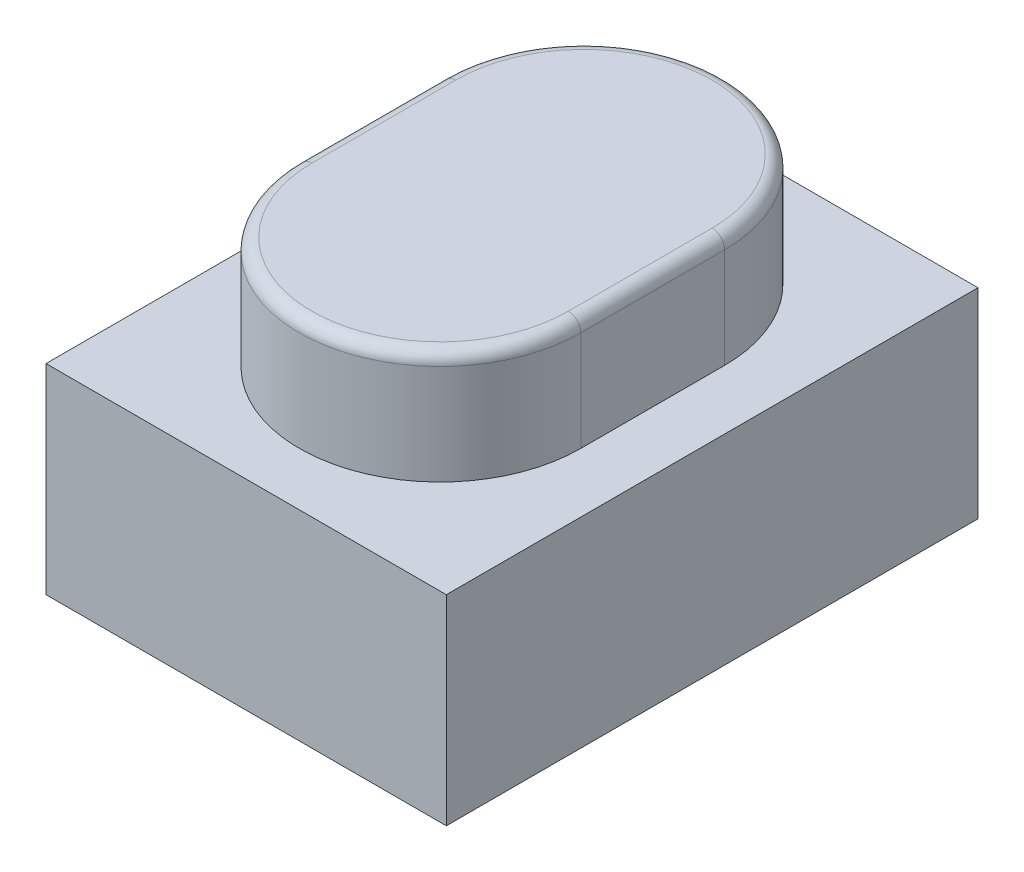
ISO-10303-21;
HEADER;
FILE_DESCRIPTION(('STEP AP214'),'2;1');
FILE_NAME('part.step','',(''),(''),'','','');
FILE_SCHEMA(('AUTOMOTIVE_DESIGN { 1 0 10303 214 1 1 1 1 }'));
ENDSEC;
DATA;
#1=APPLICATION_CONTEXT('core data for automotive mechanical design processes');
#2=APPLICATION_PROTOCOL_DEFINITION('international standard','automotive_design',2000,#1);
#3=PRODUCT_CONTEXT('',#1,'mechanical');
#4=PRODUCT('Part','Part','',(#3));
#5=PRODUCT_RELATED_PRODUCT_CATEGORY('part','',(#4));
#6=PRODUCT_DEFINITION_FORMATION('','',#4);
#7=PRODUCT_DEFINITION_CONTEXT('part definition',#1,'design');
#8=PRODUCT_DEFINITION('design','',#6,#7);
#9=PRODUCT_DEFINITION_SHAPE('','',#8);
#10=(LENGTH_UNIT() NAMED_UNIT(*) SI_UNIT(.MILLI.,.METRE.));
#11=(NAMED_UNIT(*) PLANE_ANGLE_UNIT() SI_UNIT($,.RADIAN.));
#12=(NAMED_UNIT(*) SI_UNIT($,.STERADIAN.) SOLID_ANGLE_UNIT());
#13=UNCERTAINTY_MEASURE_WITH_UNIT(LENGTH_MEASURE(1.E-05),#10,'distance_accuracy_value','');
#14=(GEOMETRIC_REPRESENTATION_CONTEXT(3) GLOBAL_UNCERTAINTY_ASSIGNED_CONTEXT((#13)) GLOBAL_UNIT_ASSIGNED_CONTEXT((#10,
#11,#12)) REPRESENTATION_CONTEXT('',''));
#15=CARTESIAN_POINT('',(0.,0.,0.));
#16=DIRECTION('',(0.,0.,1.));
#17=DIRECTION('',(1.,0.,0.));
#18=AXIS2_PLACEMENT_3D('',#15,#16,#17);
#19=CARTESIAN_POINT('',(1.6,1.6,-2.125));
#20=DIRECTION('',(-1.,0.,0.));
#21=DIRECTION('',(0.,0.,1.));
#22=AXIS2_PLACEMENT_3D('',#19,#20,#21);
#23=PLANE('',#22);
#24=DIRECTION('',(0.,0.,-1.));
#25=VECTOR('',#24,1.);
#26=CARTESIAN_POINT('',(1.6,0.,-2.125));
#27=LINE('',#26,#25);
#28=CARTESIAN_POINT('',(1.6,0.,2.125));
#29=VERTEX_POINT('',#28);
#30=CARTESIAN_POINT('',(1.6,0.,-2.125));
#31=VERTEX_POINT('',#30);
#32=EDGE_CURVE('E141',#29,#31,#27,.T.);
#33=ORIENTED_EDGE('',*,*,#32,.T.);
#34=DIRECTION('',(0.,-1.,0.));
#35=VECTOR('',#34,1.);
#36=CARTESIAN_POINT('',(1.6,1.6,-2.125));
#37=LINE('',#36,#35);
#38=CARTESIAN_POINT('',(1.6,1.6,-2.125));
#39=VERTEX_POINT('',#38);
#40=EDGE_CURVE('E168',#39,#31,#37,.T.);
#41=ORIENTED_EDGE('',*,*,#40,.F.);
#42=DIRECTION('',(0.,0.,-1.));
#43=VECTOR('',#42,1.);
#44=CARTESIAN_POINT('',(1.6,1.6,-2.125));
#45=LINE('',#44,#43);
#46=CARTESIAN_POINT('',(1.6,1.6,2.125));
#47=VERTEX_POINT('',#46);
#48=EDGE_CURVE('E142',#47,#39,#45,.T.);
#49=ORIENTED_EDGE('',*,*,#48,.F.);
#50=DIRECTION('',(0.,-1.,0.));
#51=VECTOR('',#50,1.);
#52=CARTESIAN_POINT('',(1.6,1.6,2.125));
#53=LINE('',#52,#51);
#54=EDGE_CURVE('E152',#47,#29,#53,.T.);
#55=ORIENTED_EDGE('',*,*,#54,.T.);
#56=EDGE_LOOP('',(#33,#41,#49,#55));
#57=FACE_BOUND('',#56,.T.);
#58=ADVANCED_FACE('F36',(#57),#23,.F.);
#59=CARTESIAN_POINT('',(-1.6,1.6,-2.125));
#60=DIRECTION('',(0.,0.,1.));
#61=DIRECTION('',(1.,0.,0.));
#62=AXIS2_PLACEMENT_3D('',#59,#60,#61);
#63=PLANE('',#62);
#64=DIRECTION('',(-1.,0.,0.));
#65=VECTOR('',#64,1.);
#66=CARTESIAN_POINT('',(-1.6,0.,-2.125));
#67=LINE('',#66,#65);
#68=CARTESIAN_POINT('',(-1.6,0.,-2.125));
#69=VERTEX_POINT('',#68);
#70=EDGE_CURVE('E155',#31,#69,#67,.T.);
#71=ORIENTED_EDGE('',*,*,#70,.T.);
#72=DIRECTION('',(0.,-1.,0.));
#73=VECTOR('',#72,1.);
#74=CARTESIAN_POINT('',(-1.6,1.6,-2.125));
#75=LINE('',#74,#73);
#76=CARTESIAN_POINT('',(-1.6,1.6,-2.125));
#77=VERTEX_POINT('',#76);
#78=EDGE_CURVE('E165',#77,#69,#75,.T.);
#79=ORIENTED_EDGE('',*,*,#78,.F.);
#80=DIRECTION('',(-1.,0.,0.));
#81=VECTOR('',#80,1.);
#82=CARTESIAN_POINT('',(-1.6,1.6,-2.125));
#83=LINE('',#82,#81);
#84=EDGE_CURVE('E145',#39,#77,#83,.T.);
#85=ORIENTED_EDGE('',*,*,#84,.F.);
#86=ORIENTED_EDGE('',*,*,#40,.T.);
#87=EDGE_LOOP('',(#71,#79,#85,#86));
#88=FACE_BOUND('',#87,.T.);
#89=ADVANCED_FACE('F223',(#88),#63,.F.);
#90=CARTESIAN_POINT('',(-1.6,1.6,-2.125));
#91=DIRECTION('',(1.,0.,0.));
#92=DIRECTION('',(0.,0.,-1.));
#93=AXIS2_PLACEMENT_3D('',#90,#91,#92);
#94=PLANE('',#93);
#95=DIRECTION('',(0.,0.,1.));
#96=VECTOR('',#95,1.);
#97=CARTESIAN_POINT('',(-1.6,0.,-2.125));
#98=LINE('',#97,#96);
#99=CARTESIAN_POINT('',(-1.6,0.,2.125));
#100=VERTEX_POINT('',#99);
#101=EDGE_CURVE('E157',#69,#100,#98,.T.);
#102=ORIENTED_EDGE('',*,*,#101,.T.);
#103=DIRECTION('',(0.,-1.,0.));
#104=VECTOR('',#103,1.);
#105=CARTESIAN_POINT('',(-1.6,1.6,2.125));
#106=LINE('',#105,#104);
#107=CARTESIAN_POINT('',(-1.6,1.6,2.125));
#108=VERTEX_POINT('',#107);
#109=EDGE_CURVE('E162',#108,#100,#106,.T.);
#110=ORIENTED_EDGE('',*,*,#109,.F.);
#111=DIRECTION('',(0.,0.,1.));
#112=VECTOR('',#111,1.);
#113=CARTESIAN_POINT('',(-1.6,1.6,-2.125));
#114=LINE('',#113,#112);
#115=EDGE_CURVE('E148',#77,#108,#114,.T.);
#116=ORIENTED_EDGE('',*,*,#115,.F.);
#117=ORIENTED_EDGE('',*,*,#78,.T.);
#118=EDGE_LOOP('',(#102,#110,#116,#117));
#119=FACE_BOUND('',#118,.T.);
#120=ADVANCED_FACE('F229',(#119),#94,.F.);
#121=CARTESIAN_POINT('',(-1.6,1.6,2.125));
#122=DIRECTION('',(0.,0.,-1.));
#123=DIRECTION('',(-1.,0.,0.));
#124=AXIS2_PLACEMENT_3D('',#121,#122,#123);
#125=PLANE('',#124);
#126=DIRECTION('',(1.,0.,0.));
#127=VECTOR('',#126,1.);
#128=CARTESIAN_POINT('',(-1.6,0.,2.125));
#129=LINE('',#128,#127);
#130=EDGE_CURVE('E146',#100,#29,#129,.T.);
#131=ORIENTED_EDGE('',*,*,#130,.T.);
#132=ORIENTED_EDGE('',*,*,#54,.F.);
#133=DIRECTION('',(1.,0.,0.));
#134=VECTOR('',#133,1.);
#135=CARTESIAN_POINT('',(-1.6,1.6,2.125));
#136=LINE('',#135,#134);
#137=EDGE_CURVE('E150',#108,#47,#136,.T.);
#138=ORIENTED_EDGE('',*,*,#137,.F.);
#139=ORIENTED_EDGE('',*,*,#109,.T.);
#140=EDGE_LOOP('',(#131,#132,#138,#139));
#141=FACE_BOUND('',#140,.T.);
#142=ADVANCED_FACE('F308',(#141),#125,.F.);
#143=CARTESIAN_POINT('',(0.,1.6,0.));
#144=DIRECTION('',(0.,1.,0.));
#145=DIRECTION('',(0.,0.,1.));
#146=AXIS2_PLACEMENT_3D('',#143,#144,#145);
#147=PLANE('',#146);
#148=CARTESIAN_POINT('',(0.,1.6,-0.575));
#149=DIRECTION('',(0.,1.,0.));
#150=DIRECTION('',(0.,0.,1.));
#151=AXIS2_PLACEMENT_3D('',#148,#149,#150);
#152=CIRCLE('',#151,1.125);
#153=CARTESIAN_POINT('',(1.125,1.6,-0.575000000000001));
#154=VERTEX_POINT('',#153);
#155=CARTESIAN_POINT('',(-1.125,1.6,-0.575));
#156=VERTEX_POINT('',#155);
#157=EDGE_CURVE('E132',#154,#156,#152,.T.);
#158=ORIENTED_EDGE('',*,*,#157,.F.);
#159=DIRECTION('',(0.,0.,-1.));
#160=VECTOR('',#159,1.);
#161=CARTESIAN_POINT('',(1.125,1.6,-0.575000000000001));
#162=LINE('',#161,#160);
#163=CARTESIAN_POINT('',(1.125,1.6,0.575));
#164=VERTEX_POINT('',#163);
#165=EDGE_CURVE('E129',#164,#154,#162,.T.);
#166=ORIENTED_EDGE('',*,*,#165,.F.);
#167=CARTESIAN_POINT('',(0.,1.6,0.575));
#168=DIRECTION('',(0.,1.,0.));
#169=DIRECTION('',(0.,0.,1.));
#170=AXIS2_PLACEMENT_3D('',#167,#168,#169);
#171=CIRCLE('',#170,1.125);
#172=CARTESIAN_POINT('',(-1.125,1.6,0.575));
#173=VERTEX_POINT('',#172);
#174=EDGE_CURVE('E115',#173,#164,#171,.T.);
#175=ORIENTED_EDGE('',*,*,#174,.F.);
#176=DIRECTION('',(0.,0.,1.));
#177=VECTOR('',#176,1.);
#178=CARTESIAN_POINT('',(-1.125,1.6,-0.575));
#179=LINE('',#178,#177);
#180=EDGE_CURVE('E126',#156,#173,#179,.T.);
#181=ORIENTED_EDGE('',*,*,#180,.F.);
#182=EDGE_LOOP('',(#158,#166,#175,#181));
#183=FACE_BOUND('',#182,.T.);
#184=ORIENTED_EDGE('',*,*,#48,.T.);
#185=ORIENTED_EDGE('',*,*,#84,.T.);
#186=ORIENTED_EDGE('',*,*,#115,.T.);
#187=ORIENTED_EDGE('',*,*,#137,.T.);
#188=EDGE_LOOP('',(#184,#185,#186,#187));
#189=FACE_BOUND('',#188,.T.);
#190=ADVANCED_FACE('F124',(#183,#189),#147,.T.);
#191=CARTESIAN_POINT('',(0.,0.,0.));
#192=DIRECTION('',(0.,1.,0.));
#193=DIRECTION('',(0.,0.,1.));
#194=AXIS2_PLACEMENT_3D('',#191,#192,#193);
#195=PLANE('',#194);
#196=ORIENTED_EDGE('',*,*,#32,.F.);
#197=ORIENTED_EDGE('',*,*,#130,.F.);
#198=ORIENTED_EDGE('',*,*,#101,.F.);
#199=ORIENTED_EDGE('',*,*,#70,.F.);
#200=EDGE_LOOP('',(#196,#197,#198,#199));
#201=FACE_BOUND('',#200,.T.);
#202=ADVANCED_FACE('F291',(#201),#195,.F.);
#203=CARTESIAN_POINT('',(0.,2.5,-0.575));
#204=DIRECTION('',(0.,-1.,0.));
#205=DIRECTION('',(0.,0.,-1.));
#206=AXIS2_PLACEMENT_3D('',#203,#204,#205);
#207=CYLINDRICAL_SURFACE('',#206,1.125);
#208=DIRECTION('',(0.,-1.,0.));
#209=VECTOR('',#208,1.);
#210=CARTESIAN_POINT('',(-1.125,2.5,-0.575));
#211=LINE('',#210,#209);
#212=CARTESIAN_POINT('',(-1.125,2.4,-0.575));
#213=VERTEX_POINT('',#212);
#214=EDGE_CURVE('E117',#213,#156,#211,.T.);
#215=ORIENTED_EDGE('',*,*,#214,.F.);
#216=CARTESIAN_POINT('',(0.,2.4,-0.575));
#217=DIRECTION('',(0.,1.,0.));
#218=DIRECTION('',(0.,0.,1.));
#219=AXIS2_PLACEMENT_3D('',#216,#217,#218);
#220=CIRCLE('',#219,1.125);
#221=CARTESIAN_POINT('',(1.125,2.4,-0.575000000000001));
#222=VERTEX_POINT('',#221);
#223=EDGE_CURVE('E11',#213,#222,#220,.F.);
#224=ORIENTED_EDGE('',*,*,#223,.T.);
#225=DIRECTION('',(0.,-1.,0.));
#226=VECTOR('',#225,1.);
#227=CARTESIAN_POINT('',(1.125,2.5,-0.575000000000001));
#228=LINE('',#227,#226);
#229=EDGE_CURVE('E137',#222,#154,#228,.T.);
#230=ORIENTED_EDGE('',*,*,#229,.T.);
#231=ORIENTED_EDGE('',*,*,#157,.T.);
#232=EDGE_LOOP('',(#215,#224,#230,#231));
#233=FACE_BOUND('',#232,.T.);
#234=ADVANCED_FACE('F206',(#233),#207,.T.);
#235=CARTESIAN_POINT('',(-1.125,2.5,-0.575));
#236=DIRECTION('',(1.,0.,0.));
#237=DIRECTION('',(0.,0.,-1.));
#238=AXIS2_PLACEMENT_3D('',#235,#236,#237);
#239=PLANE('',#238);
#240=DIRECTION('',(0.,-1.,0.));
#241=VECTOR('',#240,1.);
#242=CARTESIAN_POINT('',(-1.125,2.5,0.575));
#243=LINE('',#242,#241);
#244=CARTESIAN_POINT('',(-1.125,2.4,0.575));
#245=VERTEX_POINT('',#244);
#246=EDGE_CURVE('E112',#245,#173,#243,.T.);
#247=ORIENTED_EDGE('',*,*,#246,.F.);
#248=DIRECTION('',(0.,0.,1.));
#249=VECTOR('',#248,1.);
#250=CARTESIAN_POINT('',(-1.125,2.4,-0.575));
#251=LINE('',#250,#249);
#252=EDGE_CURVE('E45',#245,#213,#251,.F.);
#253=ORIENTED_EDGE('',*,*,#252,.T.);
#254=ORIENTED_EDGE('',*,*,#214,.T.);
#255=ORIENTED_EDGE('',*,*,#180,.T.);
#256=EDGE_LOOP('',(#247,#253,#254,#255));
#257=FACE_BOUND('',#256,.T.);
#258=ADVANCED_FACE('F131',(#257),#239,.F.);
#259=CARTESIAN_POINT('',(0.,2.5,0.575));
#260=DIRECTION('',(0.,-1.,0.));
#261=DIRECTION('',(0.,0.,-1.));
#262=AXIS2_PLACEMENT_3D('',#259,#260,#261);
#263=CYLINDRICAL_SURFACE('',#262,1.125);
#264=DIRECTION('',(0.,-1.,0.));
#265=VECTOR('',#264,1.);
#266=CARTESIAN_POINT('',(1.125,2.5,0.575));
#267=LINE('',#266,#265);
#268=CARTESIAN_POINT('',(1.125,2.4,0.575));
#269=VERTEX_POINT('',#268);
#270=EDGE_CURVE('E118',#269,#164,#267,.T.);
#271=ORIENTED_EDGE('',*,*,#270,.F.);
#272=CARTESIAN_POINT('',(0.,2.4,0.575));
#273=DIRECTION('',(0.,1.,0.));
#274=DIRECTION('',(0.,0.,1.));
#275=AXIS2_PLACEMENT_3D('',#272,#273,#274);
#276=CIRCLE('',#275,1.125);
#277=EDGE_CURVE('E60',#269,#245,#276,.F.);
#278=ORIENTED_EDGE('',*,*,#277,.T.);
#279=ORIENTED_EDGE('',*,*,#246,.T.);
#280=ORIENTED_EDGE('',*,*,#174,.T.);
#281=EDGE_LOOP('',(#271,#278,#279,#280));
#282=FACE_BOUND('',#281,.T.);
#283=ADVANCED_FACE('F114',(#282),#263,.T.);
#284=CARTESIAN_POINT('',(1.125,2.5,-0.575000000000001));
#285=DIRECTION('',(-1.,0.,0.));
#286=DIRECTION('',(0.,0.,1.));
#287=AXIS2_PLACEMENT_3D('',#284,#285,#286);
#288=PLANE('',#287);
#289=ORIENTED_EDGE('',*,*,#229,.F.);
#290=DIRECTION('',(0.,0.,-1.));
#291=VECTOR('',#290,1.);
#292=CARTESIAN_POINT('',(1.125,2.4,0.575));
#293=LINE('',#292,#291);
#294=EDGE_CURVE('E180',#222,#269,#293,.F.);
#295=ORIENTED_EDGE('',*,*,#294,.T.);
#296=ORIENTED_EDGE('',*,*,#270,.T.);
#297=ORIENTED_EDGE('',*,*,#165,.T.);
#298=EDGE_LOOP('',(#289,#295,#296,#297));
#299=FACE_BOUND('',#298,.T.);
#300=ADVANCED_FACE('F209',(#299),#288,.F.);
#301=CARTESIAN_POINT('',(0.,2.5,-0.575));
#302=DIRECTION('',(0.,1.,0.));
#303=DIRECTION('',(0.,0.,1.));
#304=AXIS2_PLACEMENT_3D('',#301,#302,#303);
#305=PLANE('',#304);
#306=CARTESIAN_POINT('',(0.,2.5,0.575));
#307=DIRECTION('',(0.,1.,0.));
#308=DIRECTION('',(0.,0.,1.));
#309=AXIS2_PLACEMENT_3D('',#306,#307,#308);
#310=CIRCLE('',#309,1.025);
#311=CARTESIAN_POINT('',(-1.025,2.5,0.575));
#312=VERTEX_POINT('',#311);
#313=CARTESIAN_POINT('',(1.025,2.5,0.575));
#314=VERTEX_POINT('',#313);
#315=EDGE_CURVE('E175',#312,#314,#310,.T.);
#316=ORIENTED_EDGE('',*,*,#315,.T.);
#317=DIRECTION('',(0.,0.,-1.));
#318=VECTOR('',#317,1.);
#319=CARTESIAN_POINT('',(1.025,2.5,-0.575000000000001));
#320=LINE('',#319,#318);
#321=CARTESIAN_POINT('',(1.025,2.5,-0.575000000000001));
#322=VERTEX_POINT('',#321);
#323=EDGE_CURVE('E177',#314,#322,#320,.T.);
#324=ORIENTED_EDGE('',*,*,#323,.T.);
#325=CARTESIAN_POINT('',(0.,2.5,-0.575));
#326=DIRECTION('',(0.,1.,0.));
#327=DIRECTION('',(0.,0.,1.));
#328=AXIS2_PLACEMENT_3D('',#325,#326,#327);
#329=CIRCLE('',#328,1.025);
#330=CARTESIAN_POINT('',(-1.025,2.5,-0.575));
#331=VERTEX_POINT('',#330);
#332=EDGE_CURVE('E171',#322,#331,#329,.T.);
#333=ORIENTED_EDGE('',*,*,#332,.T.);
#334=DIRECTION('',(0.,0.,1.));
#335=VECTOR('',#334,1.);
#336=CARTESIAN_POINT('',(-1.025,2.5,0.575));
#337=LINE('',#336,#335);
#338=EDGE_CURVE('E173',#331,#312,#337,.T.);
#339=ORIENTED_EDGE('',*,*,#338,.T.);
#340=EDGE_LOOP('',(#316,#324,#333,#339));
#341=FACE_BOUND('',#340,.T.);
#342=ADVANCED_FACE('F214',(#341),#305,.T.);
#343=CARTESIAN_POINT('',(-1.025,2.4,-0.575));
#344=DIRECTION('',(0.,0.,-1.));
#345=DIRECTION('',(-1.,0.,0.));
#346=AXIS2_PLACEMENT_3D('',#343,#344,#345);
#347=CYLINDRICAL_SURFACE('',#346,0.1);
#348=CARTESIAN_POINT('',(-1.025,2.4,-0.575));
#349=DIRECTION('',(0.,0.,-1.));
#350=DIRECTION('',(-1.,0.,0.));
#351=AXIS2_PLACEMENT_3D('',#348,#349,#350);
#352=CIRCLE('',#351,0.1);
#353=EDGE_CURVE('E188',#213,#331,#352,.T.);
#354=ORIENTED_EDGE('',*,*,#353,.F.);
#355=ORIENTED_EDGE('',*,*,#252,.F.);
#356=CARTESIAN_POINT('',(-1.025,2.4,0.575));
#357=DIRECTION('',(0.,0.,1.));
#358=DIRECTION('',(1.,0.,0.));
#359=AXIS2_PLACEMENT_3D('',#356,#357,#358);
#360=CIRCLE('',#359,0.1);
#361=EDGE_CURVE('E40',#312,#245,#360,.T.);
#362=ORIENTED_EDGE('',*,*,#361,.F.);
#363=ORIENTED_EDGE('',*,*,#338,.F.);
#364=EDGE_LOOP('',(#354,#355,#362,#363));
#365=FACE_BOUND('',#364,.T.);
#366=ADVANCED_FACE('F38',(#365),#347,.T.);
#367=CARTESIAN_POINT('',(0.,2.4,0.575));
#368=DIRECTION('',(0.,1.,0.));
#369=DIRECTION('',(0.,0.,1.));
#370=AXIS2_PLACEMENT_3D('',#367,#368,#369);
#371=TOROIDAL_SURFACE('',#370,1.025,0.1);
#372=ORIENTED_EDGE('',*,*,#361,.T.);
#373=ORIENTED_EDGE('',*,*,#277,.F.);
#374=CARTESIAN_POINT('',(1.025,2.4,0.575));
#375=DIRECTION('',(0.,0.,-1.));
#376=DIRECTION('',(-1.,0.,0.));
#377=AXIS2_PLACEMENT_3D('',#374,#375,#376);
#378=CIRCLE('',#377,0.1);
#379=EDGE_CURVE('E187',#314,#269,#378,.T.);
#380=ORIENTED_EDGE('',*,*,#379,.F.);
#381=ORIENTED_EDGE('',*,*,#315,.F.);
#382=EDGE_LOOP('',(#372,#373,#380,#381));
#383=FACE_BOUND('',#382,.T.);
#384=ADVANCED_FACE('F198',(#383),#371,.T.);
#385=CARTESIAN_POINT('',(0.,2.4,-0.575));
#386=DIRECTION('',(0.,1.,0.));
#387=DIRECTION('',(0.,0.,1.));
#388=AXIS2_PLACEMENT_3D('',#385,#386,#387);
#389=TOROIDAL_SURFACE('',#388,1.025,0.1);
#390=ORIENTED_EDGE('',*,*,#353,.T.);
#391=ORIENTED_EDGE('',*,*,#332,.F.);
#392=CARTESIAN_POINT('',(1.025,2.4,-0.575000000000001));
#393=DIRECTION('',(0.,0.,1.));
#394=DIRECTION('',(1.,0.,0.));
#395=AXIS2_PLACEMENT_3D('',#392,#393,#394);
#396=CIRCLE('',#395,0.1);
#397=EDGE_CURVE('E185',#222,#322,#396,.T.);
#398=ORIENTED_EDGE('',*,*,#397,.F.);
#399=ORIENTED_EDGE('',*,*,#223,.F.);
#400=EDGE_LOOP('',(#390,#391,#398,#399));
#401=FACE_BOUND('',#400,.T.);
#402=ADVANCED_FACE('F203',(#401),#389,.T.);
#403=CARTESIAN_POINT('',(1.025,2.4,-0.575));
#404=DIRECTION('',(0.,0.,1.));
#405=DIRECTION('',(1.,0.,0.));
#406=AXIS2_PLACEMENT_3D('',#403,#404,#405);
#407=CYLINDRICAL_SURFACE('',#406,0.1);
#408=ORIENTED_EDGE('',*,*,#379,.T.);
#409=ORIENTED_EDGE('',*,*,#294,.F.);
#410=ORIENTED_EDGE('',*,*,#397,.T.);
#411=ORIENTED_EDGE('',*,*,#323,.F.);
#412=EDGE_LOOP('',(#408,#409,#410,#411));
#413=FACE_BOUND('',#412,.T.);
#414=ADVANCED_FACE('F211',(#413),#407,.T.);
#415=CLOSED_SHELL('',(#58,#89,#120,#142,#190,#202,#234,#258,#283,#300,#342,#366,#384,#402,#414));
#416=MANIFOLD_SOLID_BREP('B2',#415);
#417=ADVANCED_BREP_SHAPE_REPRESENTATION('',(#18,#416),#14);
#418=SHAPE_DEFINITION_REPRESENTATION(#9,#417);
ENDSEC;
END-ISO-10303-21;
